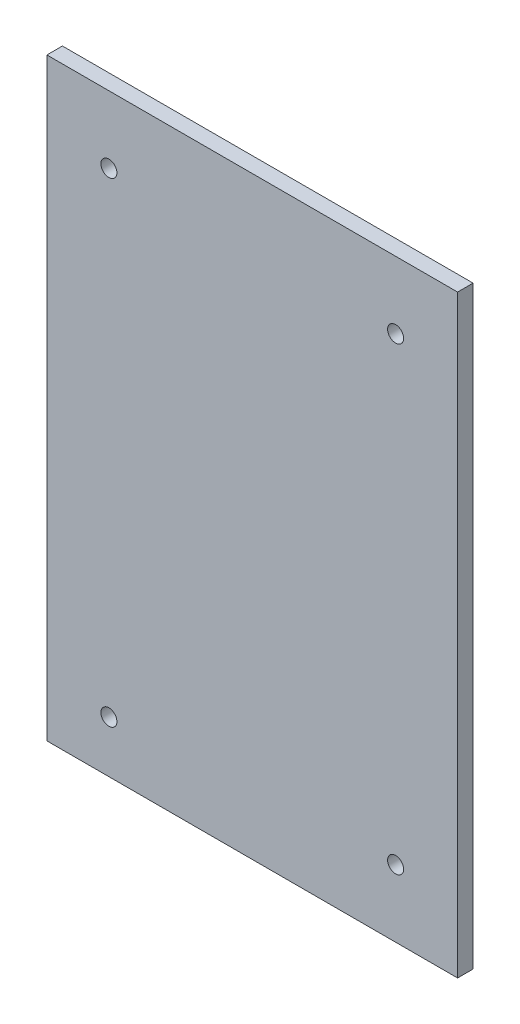
ISO-10303-21;
HEADER;
FILE_DESCRIPTION(('STEP AP214'),'2;1');
FILE_NAME('part.step','',(''),(''),'','','');
FILE_SCHEMA(('AUTOMOTIVE_DESIGN { 1 0 10303 214 1 1 1 1 }'));
ENDSEC;
DATA;
#1=APPLICATION_CONTEXT('core data for automotive mechanical design processes');
#2=APPLICATION_PROTOCOL_DEFINITION('international standard','automotive_design',2000,#1);
#3=PRODUCT_CONTEXT('',#1,'mechanical');
#4=PRODUCT('Part','Part','',(#3));
#5=PRODUCT_RELATED_PRODUCT_CATEGORY('part','',(#4));
#6=PRODUCT_DEFINITION_FORMATION('','',#4);
#7=PRODUCT_DEFINITION_CONTEXT('part definition',#1,'design');
#8=PRODUCT_DEFINITION('design','',#6,#7);
#9=PRODUCT_DEFINITION_SHAPE('','',#8);
#10=(LENGTH_UNIT() NAMED_UNIT(*) SI_UNIT(.MILLI.,.METRE.));
#11=(NAMED_UNIT(*) PLANE_ANGLE_UNIT() SI_UNIT($,.RADIAN.));
#12=(NAMED_UNIT(*) SI_UNIT($,.STERADIAN.) SOLID_ANGLE_UNIT());
#13=UNCERTAINTY_MEASURE_WITH_UNIT(LENGTH_MEASURE(1.E-05),#10,'distance_accuracy_value','');
#14=(GEOMETRIC_REPRESENTATION_CONTEXT(3) GLOBAL_UNCERTAINTY_ASSIGNED_CONTEXT((#13)) GLOBAL_UNIT_ASSIGNED_CONTEXT((#10,
#11,#12)) REPRESENTATION_CONTEXT('',''));
#15=CARTESIAN_POINT('',(0.,0.,0.));
#16=DIRECTION('',(0.,0.,1.));
#17=DIRECTION('',(1.,0.,0.));
#18=AXIS2_PLACEMENT_3D('',#15,#16,#17);
#19=CARTESIAN_POINT('',(0.,0.,3.));
#20=DIRECTION('',(0.,0.,-1.));
#21=DIRECTION('',(-1.,0.,0.));
#22=AXIS2_PLACEMENT_3D('',#19,#20,#21);
#23=PLANE('',#22);
#24=DIRECTION('',(0.,1.,0.));
#25=VECTOR('',#24,1.);
#26=CARTESIAN_POINT('',(39.75,-57.5,3.));
#27=LINE('',#26,#25);
#28=CARTESIAN_POINT('',(39.75,-57.5,3.));
#29=VERTEX_POINT('',#28);
#30=CARTESIAN_POINT('',(39.75,57.5,3.));
#31=VERTEX_POINT('',#30);
#32=EDGE_CURVE('E84',#29,#31,#27,.T.);
#33=ORIENTED_EDGE('',*,*,#32,.T.);
#34=DIRECTION('',(-1.,0.,0.));
#35=VECTOR('',#34,1.);
#36=CARTESIAN_POINT('',(-39.75,57.5,3.));
#37=LINE('',#36,#35);
#38=CARTESIAN_POINT('',(-39.75,57.5,3.));
#39=VERTEX_POINT('',#38);
#40=EDGE_CURVE('E79',#31,#39,#37,.T.);
#41=ORIENTED_EDGE('',*,*,#40,.T.);
#42=DIRECTION('',(0.,-1.,0.));
#43=VECTOR('',#42,1.);
#44=CARTESIAN_POINT('',(-39.75,-57.5,3.));
#45=LINE('',#44,#43);
#46=CARTESIAN_POINT('',(-39.75,-57.5,3.));
#47=VERTEX_POINT('',#46);
#48=EDGE_CURVE('E82',#39,#47,#45,.T.);
#49=ORIENTED_EDGE('',*,*,#48,.T.);
#50=DIRECTION('',(1.,0.,0.));
#51=VECTOR('',#50,1.);
#52=CARTESIAN_POINT('',(-39.75,-57.5,3.));
#53=LINE('',#52,#51);
#54=EDGE_CURVE('E49',#47,#29,#53,.T.);
#55=ORIENTED_EDGE('',*,*,#54,.T.);
#56=EDGE_LOOP('',(#33,#41,#49,#55));
#57=FACE_BOUND('',#56,.T.);
#58=CARTESIAN_POINT('',(-27.75,44.5,3.));
#59=DIRECTION('',(0.,0.,1.));
#60=DIRECTION('',(1.,0.,0.));
#61=AXIS2_PLACEMENT_3D('',#58,#59,#60);
#62=CIRCLE('',#61,1.55);
#63=CARTESIAN_POINT('',(-26.2,44.5,3.));
#64=VERTEX_POINT('',#63);
#65=EDGE_CURVE('E99',#64,#64,#62,.T.);
#66=ORIENTED_EDGE('',*,*,#65,.F.);
#67=EDGE_LOOP('',(#66));
#68=FACE_BOUND('',#67,.T.);
#69=CARTESIAN_POINT('',(27.75,44.5,3.));
#70=DIRECTION('',(0.,0.,1.));
#71=DIRECTION('',(1.,0.,0.));
#72=AXIS2_PLACEMENT_3D('',#69,#70,#71);
#73=CIRCLE('',#72,1.55);
#74=CARTESIAN_POINT('',(29.3,44.5,3.));
#75=VERTEX_POINT('',#74);
#76=EDGE_CURVE('E114',#75,#75,#73,.T.);
#77=ORIENTED_EDGE('',*,*,#76,.F.);
#78=EDGE_LOOP('',(#77));
#79=FACE_BOUND('',#78,.T.);
#80=CARTESIAN_POINT('',(27.75,-44.5,3.));
#81=DIRECTION('',(0.,0.,1.));
#82=DIRECTION('',(-1.,0.,0.));
#83=AXIS2_PLACEMENT_3D('',#80,#81,#82);
#84=CIRCLE('',#83,1.55);
#85=CARTESIAN_POINT('',(26.2,-44.5,3.));
#86=VERTEX_POINT('',#85);
#87=EDGE_CURVE('E120',#86,#86,#84,.T.);
#88=ORIENTED_EDGE('',*,*,#87,.F.);
#89=EDGE_LOOP('',(#88));
#90=FACE_BOUND('',#89,.T.);
#91=CARTESIAN_POINT('',(-27.75,-47.5,3.));
#92=DIRECTION('',(0.,0.,1.));
#93=DIRECTION('',(-1.,0.,0.));
#94=AXIS2_PLACEMENT_3D('',#91,#92,#93);
#95=CIRCLE('',#94,1.55);
#96=CARTESIAN_POINT('',(-29.3,-47.5,3.));
#97=VERTEX_POINT('',#96);
#98=EDGE_CURVE('E126',#97,#97,#95,.T.);
#99=ORIENTED_EDGE('',*,*,#98,.F.);
#100=EDGE_LOOP('',(#99));
#101=FACE_BOUND('',#100,.T.);
#102=ADVANCED_FACE('F32',(#57,#68,#79,#90,#101),#23,.F.);
#103=CARTESIAN_POINT('',(0.,0.,0.));
#104=DIRECTION('',(0.,0.,-1.));
#105=DIRECTION('',(-1.,0.,0.));
#106=AXIS2_PLACEMENT_3D('',#103,#104,#105);
#107=PLANE('',#106);
#108=CARTESIAN_POINT('',(27.75,-44.5,0.));
#109=DIRECTION('',(0.,0.,1.));
#110=DIRECTION('',(-1.,0.,0.));
#111=AXIS2_PLACEMENT_3D('',#108,#109,#110);
#112=CIRCLE('',#111,1.55);
#113=CARTESIAN_POINT('',(26.2,-44.5,0.));
#114=VERTEX_POINT('',#113);
#115=EDGE_CURVE('E123',#114,#114,#112,.T.);
#116=ORIENTED_EDGE('',*,*,#115,.T.);
#117=EDGE_LOOP('',(#116));
#118=FACE_BOUND('',#117,.T.);
#119=CARTESIAN_POINT('',(-27.75,44.5,0.));
#120=DIRECTION('',(0.,0.,1.));
#121=DIRECTION('',(1.,0.,0.));
#122=AXIS2_PLACEMENT_3D('',#119,#120,#121);
#123=CIRCLE('',#122,1.55);
#124=CARTESIAN_POINT('',(-26.2,44.5,0.));
#125=VERTEX_POINT('',#124);
#126=EDGE_CURVE('E111',#125,#125,#123,.T.);
#127=ORIENTED_EDGE('',*,*,#126,.T.);
#128=EDGE_LOOP('',(#127));
#129=FACE_BOUND('',#128,.T.);
#130=DIRECTION('',(0.,1.,0.));
#131=VECTOR('',#130,1.);
#132=CARTESIAN_POINT('',(39.75,-57.5,0.));
#133=LINE('',#132,#131);
#134=CARTESIAN_POINT('',(39.75,-57.5,0.));
#135=VERTEX_POINT('',#134);
#136=CARTESIAN_POINT('',(39.75,57.5,0.));
#137=VERTEX_POINT('',#136);
#138=EDGE_CURVE('E96',#135,#137,#133,.T.);
#139=ORIENTED_EDGE('',*,*,#138,.F.);
#140=DIRECTION('',(1.,0.,0.));
#141=VECTOR('',#140,1.);
#142=CARTESIAN_POINT('',(-39.75,-57.5,0.));
#143=LINE('',#142,#141);
#144=CARTESIAN_POINT('',(-39.75,-57.5,0.));
#145=VERTEX_POINT('',#144);
#146=EDGE_CURVE('E72',#145,#135,#143,.T.);
#147=ORIENTED_EDGE('',*,*,#146,.F.);
#148=DIRECTION('',(0.,-1.,0.));
#149=VECTOR('',#148,1.);
#150=CARTESIAN_POINT('',(-39.75,-57.5,0.));
#151=LINE('',#150,#149);
#152=CARTESIAN_POINT('',(-39.75,57.5,0.));
#153=VERTEX_POINT('',#152);
#154=EDGE_CURVE('E66',#153,#145,#151,.T.);
#155=ORIENTED_EDGE('',*,*,#154,.F.);
#156=DIRECTION('',(-1.,0.,0.));
#157=VECTOR('',#156,1.);
#158=CARTESIAN_POINT('',(-39.75,57.5,0.));
#159=LINE('',#158,#157);
#160=EDGE_CURVE('E88',#137,#153,#159,.T.);
#161=ORIENTED_EDGE('',*,*,#160,.F.);
#162=EDGE_LOOP('',(#139,#147,#155,#161));
#163=FACE_BOUND('',#162,.T.);
#164=CARTESIAN_POINT('',(27.75,44.5,0.));
#165=DIRECTION('',(0.,0.,1.));
#166=DIRECTION('',(1.,0.,0.));
#167=AXIS2_PLACEMENT_3D('',#164,#165,#166);
#168=CIRCLE('',#167,1.55);
#169=CARTESIAN_POINT('',(29.3,44.5,0.));
#170=VERTEX_POINT('',#169);
#171=EDGE_CURVE('E117',#170,#170,#168,.T.);
#172=ORIENTED_EDGE('',*,*,#171,.T.);
#173=EDGE_LOOP('',(#172));
#174=FACE_BOUND('',#173,.T.);
#175=CARTESIAN_POINT('',(-27.75,-47.5,0.));
#176=DIRECTION('',(0.,0.,1.));
#177=DIRECTION('',(-1.,0.,0.));
#178=AXIS2_PLACEMENT_3D('',#175,#176,#177);
#179=CIRCLE('',#178,1.55);
#180=CARTESIAN_POINT('',(-29.3,-47.5,0.));
#181=VERTEX_POINT('',#180);
#182=EDGE_CURVE('E129',#181,#181,#179,.T.);
#183=ORIENTED_EDGE('',*,*,#182,.T.);
#184=EDGE_LOOP('',(#183));
#185=FACE_BOUND('',#184,.T.);
#186=ADVANCED_FACE('F107',(#118,#129,#163,#174,#185),#107,.T.);
#187=CARTESIAN_POINT('',(39.75,-57.5,3.));
#188=DIRECTION('',(-1.,0.,0.));
#189=DIRECTION('',(0.,0.,1.));
#190=AXIS2_PLACEMENT_3D('',#187,#188,#189);
#191=PLANE('',#190);
#192=ORIENTED_EDGE('',*,*,#138,.T.);
#193=DIRECTION('',(0.,0.,-1.));
#194=VECTOR('',#193,1.);
#195=CARTESIAN_POINT('',(39.75,57.5,3.));
#196=LINE('',#195,#194);
#197=EDGE_CURVE('E11',#31,#137,#196,.T.);
#198=ORIENTED_EDGE('',*,*,#197,.F.);
#199=ORIENTED_EDGE('',*,*,#32,.F.);
#200=DIRECTION('',(0.,0.,-1.));
#201=VECTOR('',#200,1.);
#202=CARTESIAN_POINT('',(39.75,-57.5,3.));
#203=LINE('',#202,#201);
#204=EDGE_CURVE('E92',#29,#135,#203,.T.);
#205=ORIENTED_EDGE('',*,*,#204,.T.);
#206=EDGE_LOOP('',(#192,#198,#199,#205));
#207=FACE_BOUND('',#206,.T.);
#208=ADVANCED_FACE('F34',(#207),#191,.F.);
#209=CARTESIAN_POINT('',(-39.75,57.5,3.));
#210=DIRECTION('',(0.,-1.,0.));
#211=DIRECTION('',(0.,0.,-1.));
#212=AXIS2_PLACEMENT_3D('',#209,#210,#211);
#213=PLANE('',#212);
#214=ORIENTED_EDGE('',*,*,#160,.T.);
#215=DIRECTION('',(0.,0.,-1.));
#216=VECTOR('',#215,1.);
#217=CARTESIAN_POINT('',(-39.75,57.5,3.));
#218=LINE('',#217,#216);
#219=EDGE_CURVE('E41',#39,#153,#218,.T.);
#220=ORIENTED_EDGE('',*,*,#219,.F.);
#221=ORIENTED_EDGE('',*,*,#40,.F.);
#222=ORIENTED_EDGE('',*,*,#197,.T.);
#223=EDGE_LOOP('',(#214,#220,#221,#222));
#224=FACE_BOUND('',#223,.T.);
#225=ADVANCED_FACE('F87',(#224),#213,.F.);
#226=CARTESIAN_POINT('',(-39.75,-57.5,3.));
#227=DIRECTION('',(1.,0.,0.));
#228=DIRECTION('',(0.,0.,-1.));
#229=AXIS2_PLACEMENT_3D('',#226,#227,#228);
#230=PLANE('',#229);
#231=ORIENTED_EDGE('',*,*,#154,.T.);
#232=DIRECTION('',(0.,0.,-1.));
#233=VECTOR('',#232,1.);
#234=CARTESIAN_POINT('',(-39.75,-57.5,3.));
#235=LINE('',#234,#233);
#236=EDGE_CURVE('E89',#47,#145,#235,.T.);
#237=ORIENTED_EDGE('',*,*,#236,.F.);
#238=ORIENTED_EDGE('',*,*,#48,.F.);
#239=ORIENTED_EDGE('',*,*,#219,.T.);
#240=EDGE_LOOP('',(#231,#237,#238,#239));
#241=FACE_BOUND('',#240,.T.);
#242=ADVANCED_FACE('F90',(#241),#230,.F.);
#243=CARTESIAN_POINT('',(-39.75,-57.5,3.));
#244=DIRECTION('',(0.,1.,0.));
#245=DIRECTION('',(0.,0.,1.));
#246=AXIS2_PLACEMENT_3D('',#243,#244,#245);
#247=PLANE('',#246);
#248=ORIENTED_EDGE('',*,*,#146,.T.);
#249=ORIENTED_EDGE('',*,*,#204,.F.);
#250=ORIENTED_EDGE('',*,*,#54,.F.);
#251=ORIENTED_EDGE('',*,*,#236,.T.);
#252=EDGE_LOOP('',(#248,#249,#250,#251));
#253=FACE_BOUND('',#252,.T.);
#254=ADVANCED_FACE('F104',(#253),#247,.F.);
#255=CARTESIAN_POINT('',(-27.75,44.5,3.));
#256=DIRECTION('',(0.,0.,-1.));
#257=DIRECTION('',(-1.,0.,0.));
#258=AXIS2_PLACEMENT_3D('',#255,#256,#257);
#259=CYLINDRICAL_SURFACE('',#258,1.55);
#260=ORIENTED_EDGE('',*,*,#65,.T.);
#261=EDGE_LOOP('',(#260));
#262=FACE_BOUND('',#261,.T.);
#263=ORIENTED_EDGE('',*,*,#126,.F.);
#264=EDGE_LOOP('',(#263));
#265=FACE_BOUND('',#264,.T.);
#266=ADVANCED_FACE('F146',(#262,#265),#259,.F.);
#267=CARTESIAN_POINT('',(27.75,44.5,3.));
#268=DIRECTION('',(0.,0.,-1.));
#269=DIRECTION('',(-1.,0.,0.));
#270=AXIS2_PLACEMENT_3D('',#267,#268,#269);
#271=CYLINDRICAL_SURFACE('',#270,1.55);
#272=ORIENTED_EDGE('',*,*,#76,.T.);
#273=EDGE_LOOP('',(#272));
#274=FACE_BOUND('',#273,.T.);
#275=ORIENTED_EDGE('',*,*,#171,.F.);
#276=EDGE_LOOP('',(#275));
#277=FACE_BOUND('',#276,.T.);
#278=ADVANCED_FACE('F192',(#274,#277),#271,.F.);
#279=CARTESIAN_POINT('',(27.75,-44.5,3.));
#280=DIRECTION('',(0.,0.,-1.));
#281=DIRECTION('',(-1.,0.,0.));
#282=AXIS2_PLACEMENT_3D('',#279,#280,#281);
#283=CYLINDRICAL_SURFACE('',#282,1.55);
#284=ORIENTED_EDGE('',*,*,#87,.T.);
#285=EDGE_LOOP('',(#284));
#286=FACE_BOUND('',#285,.T.);
#287=ORIENTED_EDGE('',*,*,#115,.F.);
#288=EDGE_LOOP('',(#287));
#289=FACE_BOUND('',#288,.T.);
#290=ADVANCED_FACE('F200',(#286,#289),#283,.F.);
#291=CARTESIAN_POINT('',(-27.75,-47.5,3.));
#292=DIRECTION('',(0.,0.,-1.));
#293=DIRECTION('',(-1.,0.,0.));
#294=AXIS2_PLACEMENT_3D('',#291,#292,#293);
#295=CYLINDRICAL_SURFACE('',#294,1.55);
#296=ORIENTED_EDGE('',*,*,#98,.T.);
#297=EDGE_LOOP('',(#296));
#298=FACE_BOUND('',#297,.T.);
#299=ORIENTED_EDGE('',*,*,#182,.F.);
#300=EDGE_LOOP('',(#299));
#301=FACE_BOUND('',#300,.T.);
#302=ADVANCED_FACE('F135',(#298,#301),#295,.F.);
#303=CLOSED_SHELL('',(#102,#186,#208,#225,#242,#254,#266,#278,#290,#302));
#304=MANIFOLD_SOLID_BREP('B2',#303);
#305=ADVANCED_BREP_SHAPE_REPRESENTATION('',(#18,#304),#14);
#306=SHAPE_DEFINITION_REPRESENTATION(#9,#305);
ENDSEC;
END-ISO-10303-21;
